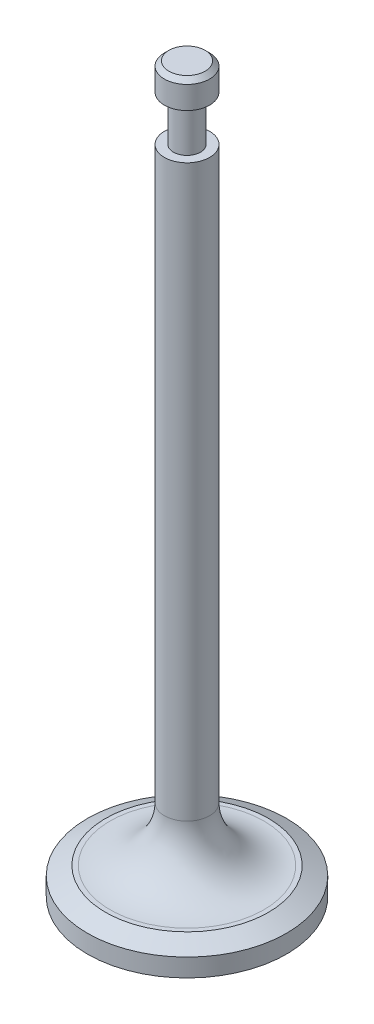
ISO-10303-21;
HEADER;
FILE_DESCRIPTION(('STEP AP214'),'2;1');
FILE_NAME('part.step','',(''),(''),'','','');
FILE_SCHEMA(('AUTOMOTIVE_DESIGN { 1 0 10303 214 1 1 1 1 }'));
ENDSEC;
DATA;
#1=APPLICATION_CONTEXT('core data for automotive mechanical design processes');
#2=APPLICATION_PROTOCOL_DEFINITION('international standard','automotive_design',2000,#1);
#3=PRODUCT_CONTEXT('',#1,'mechanical');
#4=PRODUCT('Part','Part','',(#3));
#5=PRODUCT_RELATED_PRODUCT_CATEGORY('part','',(#4));
#6=PRODUCT_DEFINITION_FORMATION('','',#4);
#7=PRODUCT_DEFINITION_CONTEXT('part definition',#1,'design');
#8=PRODUCT_DEFINITION('design','',#6,#7);
#9=PRODUCT_DEFINITION_SHAPE('','',#8);
#10=(LENGTH_UNIT() NAMED_UNIT(*) SI_UNIT(.MILLI.,.METRE.));
#11=(NAMED_UNIT(*) PLANE_ANGLE_UNIT() SI_UNIT($,.RADIAN.));
#12=(NAMED_UNIT(*) SI_UNIT($,.STERADIAN.) SOLID_ANGLE_UNIT());
#13=UNCERTAINTY_MEASURE_WITH_UNIT(LENGTH_MEASURE(1.E-05),#10,'distance_accuracy_value','');
#14=(GEOMETRIC_REPRESENTATION_CONTEXT(3) GLOBAL_UNCERTAINTY_ASSIGNED_CONTEXT((#13)) GLOBAL_UNIT_ASSIGNED_CONTEXT((#10,
#11,#12)) REPRESENTATION_CONTEXT('',''));
#15=CARTESIAN_POINT('',(0.,0.,0.));
#16=DIRECTION('',(0.,0.,1.));
#17=DIRECTION('',(1.,0.,0.));
#18=AXIS2_PLACEMENT_3D('',#15,#16,#17);
#19=CARTESIAN_POINT('',(0.,0.,-2.50000000000002));
#20=DIRECTION('',(0.,-1.,0.));
#21=DIRECTION('',(0.,0.,-1.));
#22=AXIS2_PLACEMENT_3D('',#19,#20,#21);
#23=PLANE('',#22);
#24=CARTESIAN_POINT('',(0.,0.,0.));
#25=DIRECTION('',(0.,-1.,0.));
#26=DIRECTION('',(0.,0.,-1.));
#27=AXIS2_PLACEMENT_3D('',#24,#25,#26);
#28=CIRCLE('',#27,2.00000000000002);
#29=CARTESIAN_POINT('',(0.,0.,-2.00000000000002));
#30=VERTEX_POINT('',#29);
#31=EDGE_CURVE('E41',#30,#30,#28,.F.);
#32=ORIENTED_EDGE('',*,*,#31,.T.);
#33=EDGE_LOOP('',(#32));
#34=FACE_BOUND('',#33,.T.);
#35=ADVANCED_FACE('F34',(#34),#23,.F.);
#36=CARTESIAN_POINT('',(0.,-80.,0.));
#37=DIRECTION('',(0.,1.,0.));
#38=DIRECTION('',(0.,0.,1.));
#39=AXIS2_PLACEMENT_3D('',#36,#37,#38);
#40=PLANE('',#39);
#41=CARTESIAN_POINT('',(0.,-80.,0.));
#42=DIRECTION('',(0.,1.,0.));
#43=DIRECTION('',(0.,0.,1.));
#44=AXIS2_PLACEMENT_3D('',#41,#42,#43);
#45=CIRCLE('',#44,11.);
#46=CARTESIAN_POINT('',(0.,-80.,11.));
#47=VERTEX_POINT('',#46);
#48=EDGE_CURVE('E60',#47,#47,#45,.T.);
#49=ORIENTED_EDGE('',*,*,#48,.F.);
#50=EDGE_LOOP('',(#49));
#51=FACE_BOUND('',#50,.T.);
#52=ADVANCED_FACE('F108',(#51),#40,.F.);
#53=CARTESIAN_POINT('',(0.,0.,0.));
#54=DIRECTION('',(0.,1.,0.));
#55=DIRECTION('',(0.,0.,1.));
#56=AXIS2_PLACEMENT_3D('',#53,#54,#55);
#57=CYLINDRICAL_SURFACE('',#56,11.);
#58=CARTESIAN_POINT('',(0.,-78.,0.));
#59=DIRECTION('',(0.,-1.,0.));
#60=DIRECTION('',(0.,0.,-1.));
#61=AXIS2_PLACEMENT_3D('',#58,#59,#60);
#62=CIRCLE('',#61,11.);
#63=CARTESIAN_POINT('',(0.,-78.,-11.));
#64=VERTEX_POINT('',#63);
#65=EDGE_CURVE('E45',#64,#64,#62,.T.);
#66=ORIENTED_EDGE('',*,*,#65,.T.);
#67=EDGE_LOOP('',(#66));
#68=FACE_BOUND('',#67,.T.);
#69=ORIENTED_EDGE('',*,*,#48,.T.);
#70=EDGE_LOOP('',(#69));
#71=FACE_BOUND('',#70,.T.);
#72=ADVANCED_FACE('F104',(#68,#71),#57,.T.);
#73=CARTESIAN_POINT('',(0.,-77.,-11.));
#74=DIRECTION('',(0.,-1.,0.));
#75=DIRECTION('',(0.,0.,-1.));
#76=AXIS2_PLACEMENT_3D('',#73,#74,#75);
#77=PLANE('',#76);
#78=CARTESIAN_POINT('',(0.,-77.,0.));
#79=DIRECTION('',(0.,-1.,0.));
#80=DIRECTION('',(0.,0.,-1.));
#81=AXIS2_PLACEMENT_3D('',#78,#79,#80);
#82=CIRCLE('',#81,8.99999999999997);
#83=CARTESIAN_POINT('',(0.,-77.,-8.99999999999997));
#84=VERTEX_POINT('',#83);
#85=EDGE_CURVE('E49',#84,#84,#82,.F.);
#86=ORIENTED_EDGE('',*,*,#85,.T.);
#87=EDGE_LOOP('',(#86));
#88=FACE_BOUND('',#87,.T.);
#89=CARTESIAN_POINT('',(0.,-77.,0.));
#90=DIRECTION('',(0.,-1.,0.));
#91=DIRECTION('',(0.,0.,-1.));
#92=AXIS2_PLACEMENT_3D('',#89,#90,#91);
#93=CIRCLE('',#92,8.50000000000001);
#94=CARTESIAN_POINT('',(0.,-77.,-8.50000000000001));
#95=VERTEX_POINT('',#94);
#96=EDGE_CURVE('E54',#95,#95,#93,.T.);
#97=ORIENTED_EDGE('',*,*,#96,.T.);
#98=EDGE_LOOP('',(#97));
#99=FACE_BOUND('',#98,.T.);
#100=ADVANCED_FACE('F98',(#88,#99),#77,.F.);
#101=CARTESIAN_POINT('',(0.,0.,0.));
#102=DIRECTION('',(0.,1.,0.));
#103=DIRECTION('',(0.,0.,1.));
#104=AXIS2_PLACEMENT_3D('',#101,#102,#103);
#105=CYLINDRICAL_SURFACE('',#104,2.50000000000001);
#106=CARTESIAN_POINT('',(0.,-71.,0.));
#107=DIRECTION('',(0.,-1.,0.));
#108=DIRECTION('',(0.,0.,-1.));
#109=AXIS2_PLACEMENT_3D('',#106,#107,#108);
#110=CIRCLE('',#109,2.50000000000001);
#111=CARTESIAN_POINT('',(0.,-71.,-2.50000000000001));
#112=VERTEX_POINT('',#111);
#113=EDGE_CURVE('E57',#112,#112,#110,.F.);
#114=ORIENTED_EDGE('',*,*,#113,.T.);
#115=EDGE_LOOP('',(#114));
#116=FACE_BOUND('',#115,.T.);
#117=CARTESIAN_POINT('',(0.,-8.,0.));
#118=DIRECTION('',(0.,1.,0.));
#119=DIRECTION('',(0.,0.,1.));
#120=AXIS2_PLACEMENT_3D('',#117,#118,#119);
#121=CIRCLE('',#120,2.50000000000001);
#122=CARTESIAN_POINT('',(0.,-8.,2.50000000000001));
#123=VERTEX_POINT('',#122);
#124=EDGE_CURVE('E63',#123,#123,#121,.T.);
#125=ORIENTED_EDGE('',*,*,#124,.F.);
#126=EDGE_LOOP('',(#125));
#127=FACE_BOUND('',#126,.T.);
#128=ADVANCED_FACE('F93',(#116,#127),#105,.T.);
#129=CARTESIAN_POINT('',(0.,-8.,-2.50000000000001));
#130=DIRECTION('',(0.,-1.,0.));
#131=DIRECTION('',(0.,0.,-1.));
#132=AXIS2_PLACEMENT_3D('',#129,#130,#131);
#133=PLANE('',#132);
#134=CARTESIAN_POINT('',(0.,-8.,0.));
#135=DIRECTION('',(0.,1.,0.));
#136=DIRECTION('',(0.,0.,1.));
#137=AXIS2_PLACEMENT_3D('',#134,#135,#136);
#138=CIRCLE('',#137,1.50000000000002);
#139=CARTESIAN_POINT('',(0.,-8.,1.50000000000002));
#140=VERTEX_POINT('',#139);
#141=EDGE_CURVE('E66',#140,#140,#138,.T.);
#142=ORIENTED_EDGE('',*,*,#141,.F.);
#143=EDGE_LOOP('',(#142));
#144=FACE_BOUND('',#143,.T.);
#145=ORIENTED_EDGE('',*,*,#124,.T.);
#146=EDGE_LOOP('',(#145));
#147=FACE_BOUND('',#146,.T.);
#148=ADVANCED_FACE('F87',(#144,#147),#133,.F.);
#149=CARTESIAN_POINT('',(0.,0.,0.));
#150=DIRECTION('',(0.,1.,0.));
#151=DIRECTION('',(0.,0.,1.));
#152=AXIS2_PLACEMENT_3D('',#149,#150,#151);
#153=CYLINDRICAL_SURFACE('',#152,1.50000000000002);
#154=CARTESIAN_POINT('',(0.,-3.,0.));
#155=DIRECTION('',(0.,1.,0.));
#156=DIRECTION('',(0.,0.,1.));
#157=AXIS2_PLACEMENT_3D('',#154,#155,#156);
#158=CIRCLE('',#157,1.50000000000002);
#159=CARTESIAN_POINT('',(0.,-3.,1.50000000000002));
#160=VERTEX_POINT('',#159);
#161=EDGE_CURVE('E69',#160,#160,#158,.T.);
#162=ORIENTED_EDGE('',*,*,#161,.F.);
#163=EDGE_LOOP('',(#162));
#164=FACE_BOUND('',#163,.T.);
#165=ORIENTED_EDGE('',*,*,#141,.T.);
#166=EDGE_LOOP('',(#165));
#167=FACE_BOUND('',#166,.T.);
#168=ADVANCED_FACE('F81',(#164,#167),#153,.T.);
#169=CARTESIAN_POINT('',(0.,-3.,-1.50000000000002));
#170=DIRECTION('',(0.,1.,0.));
#171=DIRECTION('',(0.,0.,1.));
#172=AXIS2_PLACEMENT_3D('',#169,#170,#171);
#173=PLANE('',#172);
#174=CARTESIAN_POINT('',(0.,-3.,0.));
#175=DIRECTION('',(0.,1.,0.));
#176=DIRECTION('',(0.,0.,1.));
#177=AXIS2_PLACEMENT_3D('',#174,#175,#176);
#178=CIRCLE('',#177,2.50000000000002);
#179=CARTESIAN_POINT('',(0.,-3.,2.50000000000002));
#180=VERTEX_POINT('',#179);
#181=EDGE_CURVE('E72',#180,#180,#178,.T.);
#182=ORIENTED_EDGE('',*,*,#181,.F.);
#183=EDGE_LOOP('',(#182));
#184=FACE_BOUND('',#183,.T.);
#185=ORIENTED_EDGE('',*,*,#161,.T.);
#186=EDGE_LOOP('',(#185));
#187=FACE_BOUND('',#186,.T.);
#188=ADVANCED_FACE('F78',(#184,#187),#173,.F.);
#189=CARTESIAN_POINT('',(0.,0.,0.));
#190=DIRECTION('',(0.,1.,0.));
#191=DIRECTION('',(0.,0.,1.));
#192=AXIS2_PLACEMENT_3D('',#189,#190,#191);
#193=CYLINDRICAL_SURFACE('',#192,2.50000000000002);
#194=CARTESIAN_POINT('',(0.,-0.500000000000006,0.));
#195=DIRECTION('',(0.,-1.,0.));
#196=DIRECTION('',(0.,0.,-1.));
#197=AXIS2_PLACEMENT_3D('',#194,#195,#196);
#198=CIRCLE('',#197,2.50000000000002);
#199=CARTESIAN_POINT('',(0.,-0.500000000000006,-2.50000000000002));
#200=VERTEX_POINT('',#199);
#201=EDGE_CURVE('E10',#200,#200,#198,.T.);
#202=ORIENTED_EDGE('',*,*,#201,.T.);
#203=EDGE_LOOP('',(#202));
#204=FACE_BOUND('',#203,.T.);
#205=ORIENTED_EDGE('',*,*,#181,.T.);
#206=EDGE_LOOP('',(#205));
#207=FACE_BOUND('',#206,.T.);
#208=ADVANCED_FACE('F76',(#204,#207),#193,.T.);
#209=CARTESIAN_POINT('',(0.,-71.,0.));
#210=DIRECTION('',(0.,-1.,0.));
#211=DIRECTION('',(0.,0.,-1.));
#212=AXIS2_PLACEMENT_3D('',#209,#210,#211);
#213=TOROIDAL_SURFACE('',#212,8.50000000000001,6.);
#214=ORIENTED_EDGE('',*,*,#96,.F.);
#215=EDGE_LOOP('',(#214));
#216=FACE_BOUND('',#215,.T.);
#217=ORIENTED_EDGE('',*,*,#113,.F.);
#218=EDGE_LOOP('',(#217));
#219=FACE_BOUND('',#218,.T.);
#220=ADVANCED_FACE('F117',(#216,#219),#213,.F.);
#221=CARTESIAN_POINT('',(0.,-77.,0.));
#222=DIRECTION('',(0.,-1.,0.));
#223=DIRECTION('',(0.,0.,-1.));
#224=AXIS2_PLACEMENT_3D('',#221,#222,#223);
#225=CONICAL_SURFACE('',#224,8.99999999999997,1.10714871779409);
#226=ORIENTED_EDGE('',*,*,#65,.F.);
#227=EDGE_LOOP('',(#226));
#228=FACE_BOUND('',#227,.T.);
#229=ORIENTED_EDGE('',*,*,#85,.F.);
#230=EDGE_LOOP('',(#229));
#231=FACE_BOUND('',#230,.T.);
#232=ADVANCED_FACE('F119',(#228,#231),#225,.T.);
#233=CARTESIAN_POINT('',(0.,0.,0.));
#234=DIRECTION('',(0.,-1.,0.));
#235=DIRECTION('',(0.,0.,-1.));
#236=AXIS2_PLACEMENT_3D('',#233,#234,#235);
#237=CONICAL_SURFACE('',#236,2.00000000000002,0.78539816339744);
#238=ORIENTED_EDGE('',*,*,#201,.F.);
#239=EDGE_LOOP('',(#238));
#240=FACE_BOUND('',#239,.T.);
#241=ORIENTED_EDGE('',*,*,#31,.F.);
#242=EDGE_LOOP('',(#241));
#243=FACE_BOUND('',#242,.T.);
#244=ADVANCED_FACE('F36',(#240,#243),#237,.T.);
#245=CLOSED_SHELL('',(#35,#52,#72,#100,#128,#148,#168,#188,#208,#220,#232,#244));
#246=MANIFOLD_SOLID_BREP('B2',#245);
#247=ADVANCED_BREP_SHAPE_REPRESENTATION('',(#18,#246),#14);
#248=SHAPE_DEFINITION_REPRESENTATION(#9,#247);
ENDSEC;
END-ISO-10303-21;
